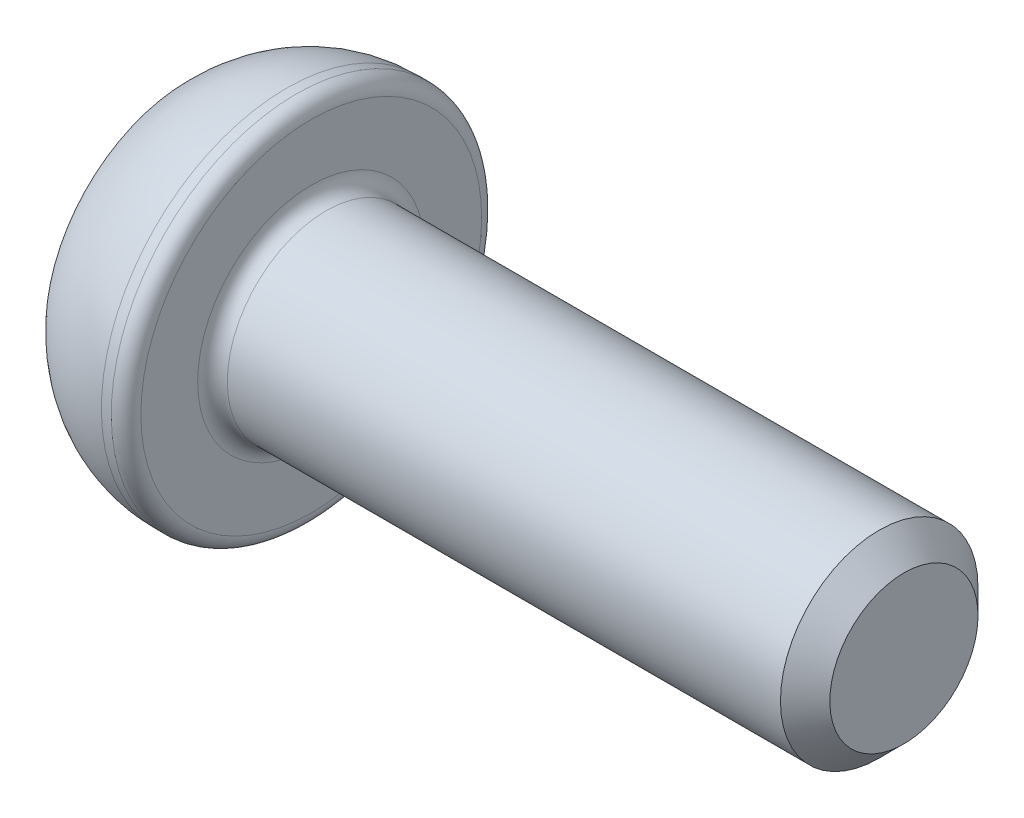
ISO-10303-21;
HEADER;
FILE_DESCRIPTION(('STEP AP214'),'2;1');
FILE_NAME('part.step','',(''),(''),'','','');
FILE_SCHEMA(('AUTOMOTIVE_DESIGN { 1 0 10303 214 1 1 1 1 }'));
ENDSEC;
DATA;
#1=APPLICATION_CONTEXT('core data for automotive mechanical design processes');
#2=APPLICATION_PROTOCOL_DEFINITION('international standard','automotive_design',2000,#1);
#3=PRODUCT_CONTEXT('',#1,'mechanical');
#4=PRODUCT('Part','Part','',(#3));
#5=PRODUCT_RELATED_PRODUCT_CATEGORY('part','',(#4));
#6=PRODUCT_DEFINITION_FORMATION('','',#4);
#7=PRODUCT_DEFINITION_CONTEXT('part definition',#1,'design');
#8=PRODUCT_DEFINITION('design','',#6,#7);
#9=PRODUCT_DEFINITION_SHAPE('','',#8);
#10=(LENGTH_UNIT() NAMED_UNIT(*) SI_UNIT(.MILLI.,.METRE.));
#11=(NAMED_UNIT(*) PLANE_ANGLE_UNIT() SI_UNIT($,.RADIAN.));
#12=(NAMED_UNIT(*) SI_UNIT($,.STERADIAN.) SOLID_ANGLE_UNIT());
#13=UNCERTAINTY_MEASURE_WITH_UNIT(LENGTH_MEASURE(1.E-05),#10,'distance_accuracy_value','');
#14=(GEOMETRIC_REPRESENTATION_CONTEXT(3) GLOBAL_UNCERTAINTY_ASSIGNED_CONTEXT((#13)) GLOBAL_UNIT_ASSIGNED_CONTEXT((#10,
#11,#12)) REPRESENTATION_CONTEXT('',''));
#15=CARTESIAN_POINT('',(0.,0.,0.));
#16=DIRECTION('',(0.,0.,1.));
#17=DIRECTION('',(1.,0.,0.));
#18=AXIS2_PLACEMENT_3D('',#15,#16,#17);
#19=CARTESIAN_POINT('',(0.,0.,0.));
#20=DIRECTION('',(-1.,0.,0.));
#21=DIRECTION('',(0.,-1.,0.));
#22=AXIS2_PLACEMENT_3D('',#19,#20,#21);
#23=PLANE('',#22);
#24=DIRECTION('',(0.,0.866025403784438,-0.5));
#25=VECTOR('',#24,1.);
#26=CARTESIAN_POINT('',(0.,0.,1.44337567297407));
#27=LINE('',#26,#25);
#28=CARTESIAN_POINT('',(0.,0.,1.44337567297407));
#29=VERTEX_POINT('',#28);
#30=CARTESIAN_POINT('',(0.,1.25,0.721687836487032));
#31=VERTEX_POINT('',#30);
#32=EDGE_CURVE('E55',#29,#31,#27,.T.);
#33=ORIENTED_EDGE('',*,*,#32,.F.);
#34=DIRECTION('',(0.,0.866025403784438,0.5));
#35=VECTOR('',#34,1.);
#36=CARTESIAN_POINT('',(0.,-1.25,0.721687836487033));
#37=LINE('',#36,#35);
#38=CARTESIAN_POINT('',(0.,-1.25,0.721687836487033));
#39=VERTEX_POINT('',#38);
#40=EDGE_CURVE('E138',#39,#29,#37,.T.);
#41=ORIENTED_EDGE('',*,*,#40,.F.);
#42=DIRECTION('',(0.,0.,1.));
#43=VECTOR('',#42,1.);
#44=CARTESIAN_POINT('',(0.,-1.25,-0.721687836487032));
#45=LINE('',#44,#43);
#46=CARTESIAN_POINT('',(0.,-1.25,-0.721687836487032));
#47=VERTEX_POINT('',#46);
#48=EDGE_CURVE('E136',#47,#39,#45,.T.);
#49=ORIENTED_EDGE('',*,*,#48,.F.);
#50=DIRECTION('',(0.,-0.866025403784438,0.5));
#51=VECTOR('',#50,1.);
#52=CARTESIAN_POINT('',(0.,0.,-1.44337567297407));
#53=LINE('',#52,#51);
#54=CARTESIAN_POINT('',(0.,0.,-1.44337567297407));
#55=VERTEX_POINT('',#54);
#56=EDGE_CURVE('E103',#55,#47,#53,.T.);
#57=ORIENTED_EDGE('',*,*,#56,.F.);
#58=DIRECTION('',(0.,-0.866025403784438,-0.5));
#59=VECTOR('',#58,1.);
#60=CARTESIAN_POINT('',(0.,1.25,-0.721687836487032));
#61=LINE('',#60,#59);
#62=CARTESIAN_POINT('',(0.,1.25,-0.721687836487032));
#63=VERTEX_POINT('',#62);
#64=EDGE_CURVE('E132',#63,#55,#61,.T.);
#65=ORIENTED_EDGE('',*,*,#64,.F.);
#66=DIRECTION('',(0.,0.,-1.));
#67=VECTOR('',#66,1.);
#68=CARTESIAN_POINT('',(0.,1.25,0.721687836487032));
#69=LINE('',#68,#67);
#70=EDGE_CURVE('E129',#31,#63,#69,.T.);
#71=ORIENTED_EDGE('',*,*,#70,.F.);
#72=EDGE_LOOP('',(#33,#41,#49,#57,#65,#71));
#73=FACE_BOUND('',#72,.T.);
#74=CARTESIAN_POINT('',(0.,0.,0.));
#75=DIRECTION('',(1.,0.,0.));
#76=DIRECTION('',(0.,1.,0.));
#77=AXIS2_PLACEMENT_3D('',#74,#75,#76);
#78=CIRCLE('',#77,2.875);
#79=CARTESIAN_POINT('',(0.,2.875,0.));
#80=VERTEX_POINT('',#79);
#81=EDGE_CURVE('E150',#80,#80,#78,.T.);
#82=ORIENTED_EDGE('',*,*,#81,.F.);
#83=EDGE_LOOP('',(#82));
#84=FACE_BOUND('',#83,.T.);
#85=ADVANCED_FACE('F39',(#73,#84),#23,.T.);
#86=CARTESIAN_POINT('',(2.,0.,0.));
#87=DIRECTION('',(1.,0.,0.));
#88=DIRECTION('',(0.,1.,0.));
#89=AXIS2_PLACEMENT_3D('',#86,#87,#88);
#90=DEGENERATE_TOROIDAL_SURFACE('',#89,1.02678571428571,2.72321428571429,.T.);
#91=ORIENTED_EDGE('',*,*,#81,.T.);
#92=EDGE_LOOP('',(#91));
#93=FACE_BOUND('',#92,.T.);
#94=CARTESIAN_POINT('',(2.,0.,0.));
#95=DIRECTION('',(1.,0.,0.));
#96=DIRECTION('',(0.,1.,0.));
#97=AXIS2_PLACEMENT_3D('',#94,#95,#96);
#98=CIRCLE('',#97,3.75);
#99=CARTESIAN_POINT('',(2.,3.75,0.));
#100=VERTEX_POINT('',#99);
#101=EDGE_CURVE('E142',#100,#100,#98,.T.);
#102=ORIENTED_EDGE('',*,*,#101,.F.);
#103=EDGE_LOOP('',(#102));
#104=FACE_BOUND('',#103,.T.);
#105=ADVANCED_FACE('F179',(#93,#104),#90,.T.);
#106=CARTESIAN_POINT('',(14.5,0.,0.));
#107=DIRECTION('',(1.,0.,0.));
#108=DIRECTION('',(0.,1.,0.));
#109=AXIS2_PLACEMENT_3D('',#106,#107,#108);
#110=CYLINDRICAL_SURFACE('',#109,3.75);
#111=CARTESIAN_POINT('',(2.2,0.,0.));
#112=DIRECTION('',(1.,0.,0.));
#113=DIRECTION('',(0.,1.,0.));
#114=AXIS2_PLACEMENT_3D('',#111,#112,#113);
#115=CIRCLE('',#114,3.75);
#116=CARTESIAN_POINT('',(2.2,3.75,0.));
#117=VERTEX_POINT('',#116);
#118=EDGE_CURVE('E162',#117,#117,#115,.F.);
#119=ORIENTED_EDGE('',*,*,#118,.T.);
#120=EDGE_LOOP('',(#119));
#121=FACE_BOUND('',#120,.T.);
#122=ORIENTED_EDGE('',*,*,#101,.T.);
#123=EDGE_LOOP('',(#122));
#124=FACE_BOUND('',#123,.T.);
#125=ADVANCED_FACE('F185',(#121,#124),#110,.T.);
#126=CARTESIAN_POINT('',(2.5,3.75,0.));
#127=DIRECTION('',(1.,0.,0.));
#128=DIRECTION('',(0.,1.,0.));
#129=AXIS2_PLACEMENT_3D('',#126,#127,#128);
#130=PLANE('',#129);
#131=CARTESIAN_POINT('',(2.5,0.,0.));
#132=DIRECTION('',(1.,0.,0.));
#133=DIRECTION('',(0.,1.,0.));
#134=AXIS2_PLACEMENT_3D('',#131,#132,#133);
#135=CIRCLE('',#134,2.3);
#136=CARTESIAN_POINT('',(2.5,2.3,0.));
#137=VERTEX_POINT('',#136);
#138=EDGE_CURVE('E159',#137,#137,#135,.F.);
#139=ORIENTED_EDGE('',*,*,#138,.T.);
#140=EDGE_LOOP('',(#139));
#141=FACE_BOUND('',#140,.T.);
#142=CARTESIAN_POINT('',(2.5,0.,0.));
#143=DIRECTION('',(1.,0.,0.));
#144=DIRECTION('',(0.,1.,0.));
#145=AXIS2_PLACEMENT_3D('',#142,#143,#144);
#146=CIRCLE('',#145,3.45);
#147=CARTESIAN_POINT('',(2.5,3.45,0.));
#148=VERTEX_POINT('',#147);
#149=EDGE_CURVE('E156',#148,#148,#146,.T.);
#150=ORIENTED_EDGE('',*,*,#149,.T.);
#151=EDGE_LOOP('',(#150));
#152=FACE_BOUND('',#151,.T.);
#153=ADVANCED_FACE('F204',(#141,#152),#130,.T.);
#154=CARTESIAN_POINT('',(14.5,0.,0.));
#155=DIRECTION('',(1.,0.,0.));
#156=DIRECTION('',(0.,1.,0.));
#157=AXIS2_PLACEMENT_3D('',#154,#155,#156);
#158=CYLINDRICAL_SURFACE('',#157,2.);
#159=CARTESIAN_POINT('',(14.,0.,0.));
#160=DIRECTION('',(1.,0.,0.));
#161=DIRECTION('',(0.,1.,0.));
#162=AXIS2_PLACEMENT_3D('',#159,#160,#161);
#163=CIRCLE('',#162,2.);
#164=CARTESIAN_POINT('',(14.,2.,0.));
#165=VERTEX_POINT('',#164);
#166=EDGE_CURVE('E11',#165,#165,#163,.F.);
#167=ORIENTED_EDGE('',*,*,#166,.T.);
#168=EDGE_LOOP('',(#167));
#169=FACE_BOUND('',#168,.T.);
#170=CARTESIAN_POINT('',(2.8,0.,0.));
#171=DIRECTION('',(1.,0.,0.));
#172=DIRECTION('',(0.,1.,0.));
#173=AXIS2_PLACEMENT_3D('',#170,#171,#172);
#174=CIRCLE('',#173,2.);
#175=CARTESIAN_POINT('',(2.8,2.,0.));
#176=VERTEX_POINT('',#175);
#177=EDGE_CURVE('E153',#176,#176,#174,.T.);
#178=ORIENTED_EDGE('',*,*,#177,.T.);
#179=EDGE_LOOP('',(#178));
#180=FACE_BOUND('',#179,.T.);
#181=ADVANCED_FACE('F202',(#169,#180),#158,.T.);
#182=CARTESIAN_POINT('',(14.5,2.,0.));
#183=DIRECTION('',(1.,0.,0.));
#184=DIRECTION('',(0.,1.,0.));
#185=AXIS2_PLACEMENT_3D('',#182,#183,#184);
#186=PLANE('',#185);
#187=CARTESIAN_POINT('',(14.5,0.,0.));
#188=DIRECTION('',(1.,0.,0.));
#189=DIRECTION('',(0.,1.,0.));
#190=AXIS2_PLACEMENT_3D('',#187,#188,#189);
#191=CIRCLE('',#190,1.49999999999999);
#192=CARTESIAN_POINT('',(14.5,1.5,0.));
#193=VERTEX_POINT('',#192);
#194=EDGE_CURVE('E48',#193,#193,#191,.T.);
#195=ORIENTED_EDGE('',*,*,#194,.T.);
#196=EDGE_LOOP('',(#195));
#197=FACE_BOUND('',#196,.T.);
#198=ADVANCED_FACE('F167',(#197),#186,.T.);
#199=CARTESIAN_POINT('',(1.5,0.,1.44337567297407));
#200=DIRECTION('',(0.,0.5,0.866025403784438));
#201=DIRECTION('',(0.,-0.866025403784439,0.5));
#202=AXIS2_PLACEMENT_3D('',#199,#200,#201);
#203=PLANE('',#202);
#204=ORIENTED_EDGE('',*,*,#32,.T.);
#205=DIRECTION('',(-1.,0.,0.));
#206=VECTOR('',#205,1.);
#207=CARTESIAN_POINT('',(1.5,1.25,0.721687836487032));
#208=LINE('',#207,#206);
#209=CARTESIAN_POINT('',(1.5,1.25,0.721687836487032));
#210=VERTEX_POINT('',#209);
#211=EDGE_CURVE('E85',#210,#31,#208,.T.);
#212=ORIENTED_EDGE('',*,*,#211,.F.);
#213=DIRECTION('',(0.,0.866025403784438,-0.5));
#214=VECTOR('',#213,1.);
#215=CARTESIAN_POINT('',(1.5,0.,1.44337567297407));
#216=LINE('',#215,#214);
#217=CARTESIAN_POINT('',(1.5,0.,1.44337567297407));
#218=VERTEX_POINT('',#217);
#219=EDGE_CURVE('E140',#218,#210,#216,.T.);
#220=ORIENTED_EDGE('',*,*,#219,.F.);
#221=DIRECTION('',(-1.,0.,0.));
#222=VECTOR('',#221,1.);
#223=CARTESIAN_POINT('',(1.5,0.,1.44337567297407));
#224=LINE('',#223,#222);
#225=EDGE_CURVE('E63',#218,#29,#224,.T.);
#226=ORIENTED_EDGE('',*,*,#225,.T.);
#227=EDGE_LOOP('',(#204,#212,#220,#226));
#228=FACE_BOUND('',#227,.T.);
#229=ADVANCED_FACE('F211',(#228),#203,.F.);
#230=CARTESIAN_POINT('',(1.5,-1.25,0.721687836487033));
#231=DIRECTION('',(0.,-0.5,0.866025403784439));
#232=DIRECTION('',(0.,-0.866025403784439,-0.5));
#233=AXIS2_PLACEMENT_3D('',#230,#231,#232);
#234=PLANE('',#233);
#235=ORIENTED_EDGE('',*,*,#40,.T.);
#236=ORIENTED_EDGE('',*,*,#225,.F.);
#237=DIRECTION('',(0.,0.866025403784438,0.5));
#238=VECTOR('',#237,1.);
#239=CARTESIAN_POINT('',(1.5,-1.25,0.721687836487033));
#240=LINE('',#239,#238);
#241=CARTESIAN_POINT('',(1.5,-1.25,0.721687836487033));
#242=VERTEX_POINT('',#241);
#243=EDGE_CURVE('E115',#242,#218,#240,.T.);
#244=ORIENTED_EDGE('',*,*,#243,.F.);
#245=DIRECTION('',(-1.,0.,0.));
#246=VECTOR('',#245,1.);
#247=CARTESIAN_POINT('',(1.5,-1.25,0.721687836487033));
#248=LINE('',#247,#246);
#249=EDGE_CURVE('E107',#242,#39,#248,.T.);
#250=ORIENTED_EDGE('',*,*,#249,.T.);
#251=EDGE_LOOP('',(#235,#236,#244,#250));
#252=FACE_BOUND('',#251,.T.);
#253=ADVANCED_FACE('F270',(#252),#234,.F.);
#254=CARTESIAN_POINT('',(1.5,-1.25,-0.721687836487032));
#255=DIRECTION('',(0.,-1.,0.));
#256=DIRECTION('',(0.,0.,-1.));
#257=AXIS2_PLACEMENT_3D('',#254,#255,#256);
#258=PLANE('',#257);
#259=ORIENTED_EDGE('',*,*,#48,.T.);
#260=ORIENTED_EDGE('',*,*,#249,.F.);
#261=DIRECTION('',(0.,0.,1.));
#262=VECTOR('',#261,1.);
#263=CARTESIAN_POINT('',(1.5,-1.25,-0.721687836487032));
#264=LINE('',#263,#262);
#265=CARTESIAN_POINT('',(1.5,-1.25,-0.721687836487032));
#266=VERTEX_POINT('',#265);
#267=EDGE_CURVE('E111',#266,#242,#264,.T.);
#268=ORIENTED_EDGE('',*,*,#267,.F.);
#269=DIRECTION('',(-1.,0.,0.));
#270=VECTOR('',#269,1.);
#271=CARTESIAN_POINT('',(1.5,-1.25,-0.721687836487032));
#272=LINE('',#271,#270);
#273=EDGE_CURVE('E96',#266,#47,#272,.T.);
#274=ORIENTED_EDGE('',*,*,#273,.T.);
#275=EDGE_LOOP('',(#259,#260,#268,#274));
#276=FACE_BOUND('',#275,.T.);
#277=ADVANCED_FACE('F112',(#276),#258,.F.);
#278=CARTESIAN_POINT('',(1.5,0.,-1.44337567297407));
#279=DIRECTION('',(0.,-0.5,-0.866025403784439));
#280=DIRECTION('',(0.,0.866025403784439,-0.5));
#281=AXIS2_PLACEMENT_3D('',#278,#279,#280);
#282=PLANE('',#281);
#283=ORIENTED_EDGE('',*,*,#56,.T.);
#284=ORIENTED_EDGE('',*,*,#273,.F.);
#285=DIRECTION('',(0.,-0.866025403784438,0.5));
#286=VECTOR('',#285,1.);
#287=CARTESIAN_POINT('',(1.5,0.,-1.44337567297407));
#288=LINE('',#287,#286);
#289=CARTESIAN_POINT('',(1.5,0.,-1.44337567297407));
#290=VERTEX_POINT('',#289);
#291=EDGE_CURVE('E100',#290,#266,#288,.T.);
#292=ORIENTED_EDGE('',*,*,#291,.F.);
#293=DIRECTION('',(-1.,0.,0.));
#294=VECTOR('',#293,1.);
#295=CARTESIAN_POINT('',(1.5,0.,-1.44337567297407));
#296=LINE('',#295,#294);
#297=EDGE_CURVE('E108',#290,#55,#296,.T.);
#298=ORIENTED_EDGE('',*,*,#297,.T.);
#299=EDGE_LOOP('',(#283,#284,#292,#298));
#300=FACE_BOUND('',#299,.T.);
#301=ADVANCED_FACE('F98',(#300),#282,.F.);
#302=CARTESIAN_POINT('',(1.5,1.25,-0.721687836487032));
#303=DIRECTION('',(0.,0.5,-0.866025403784438));
#304=DIRECTION('',(0.,0.866025403784439,0.5));
#305=AXIS2_PLACEMENT_3D('',#302,#303,#304);
#306=PLANE('',#305);
#307=ORIENTED_EDGE('',*,*,#64,.T.);
#308=ORIENTED_EDGE('',*,*,#297,.F.);
#309=DIRECTION('',(0.,-0.866025403784438,-0.5));
#310=VECTOR('',#309,1.);
#311=CARTESIAN_POINT('',(1.5,1.25,-0.721687836487032));
#312=LINE('',#311,#310);
#313=CARTESIAN_POINT('',(1.5,1.25,-0.721687836487032));
#314=VERTEX_POINT('',#313);
#315=EDGE_CURVE('E121',#314,#290,#312,.T.);
#316=ORIENTED_EDGE('',*,*,#315,.F.);
#317=DIRECTION('',(-1.,0.,0.));
#318=VECTOR('',#317,1.);
#319=CARTESIAN_POINT('',(1.5,1.25,-0.721687836487032));
#320=LINE('',#319,#318);
#321=EDGE_CURVE('E145',#314,#63,#320,.T.);
#322=ORIENTED_EDGE('',*,*,#321,.T.);
#323=EDGE_LOOP('',(#307,#308,#316,#322));
#324=FACE_BOUND('',#323,.T.);
#325=ADVANCED_FACE('F287',(#324),#306,.F.);
#326=CARTESIAN_POINT('',(1.5,1.25,0.721687836487032));
#327=DIRECTION('',(0.,1.,0.));
#328=DIRECTION('',(0.,0.,1.));
#329=AXIS2_PLACEMENT_3D('',#326,#327,#328);
#330=PLANE('',#329);
#331=ORIENTED_EDGE('',*,*,#70,.T.);
#332=ORIENTED_EDGE('',*,*,#321,.F.);
#333=DIRECTION('',(0.,0.,-1.));
#334=VECTOR('',#333,1.);
#335=CARTESIAN_POINT('',(1.5,1.25,0.721687836487032));
#336=LINE('',#335,#334);
#337=EDGE_CURVE('E123',#210,#314,#336,.T.);
#338=ORIENTED_EDGE('',*,*,#337,.F.);
#339=ORIENTED_EDGE('',*,*,#211,.T.);
#340=EDGE_LOOP('',(#331,#332,#338,#339));
#341=FACE_BOUND('',#340,.T.);
#342=ADVANCED_FACE('F196',(#341),#330,.F.);
#343=CARTESIAN_POINT('',(1.5,0.,0.));
#344=DIRECTION('',(-1.,0.,0.));
#345=DIRECTION('',(0.,0.,1.));
#346=AXIS2_PLACEMENT_3D('',#343,#344,#345);
#347=PLANE('',#346);
#348=ORIENTED_EDGE('',*,*,#219,.T.);
#349=ORIENTED_EDGE('',*,*,#337,.T.);
#350=ORIENTED_EDGE('',*,*,#315,.T.);
#351=ORIENTED_EDGE('',*,*,#291,.T.);
#352=ORIENTED_EDGE('',*,*,#267,.T.);
#353=ORIENTED_EDGE('',*,*,#243,.T.);
#354=EDGE_LOOP('',(#348,#349,#350,#351,#352,#353));
#355=FACE_BOUND('',#354,.T.);
#356=ADVANCED_FACE('F118',(#355),#347,.T.);
#357=CARTESIAN_POINT('',(2.8,0.,0.));
#358=DIRECTION('',(1.,0.,0.));
#359=DIRECTION('',(0.,1.,0.));
#360=AXIS2_PLACEMENT_3D('',#357,#358,#359);
#361=TOROIDAL_SURFACE('',#360,2.3,0.3);
#362=ORIENTED_EDGE('',*,*,#138,.F.);
#363=EDGE_LOOP('',(#362));
#364=FACE_BOUND('',#363,.T.);
#365=ORIENTED_EDGE('',*,*,#177,.F.);
#366=EDGE_LOOP('',(#365));
#367=FACE_BOUND('',#366,.T.);
#368=ADVANCED_FACE('F175',(#364,#367),#361,.F.);
#369=CARTESIAN_POINT('',(2.2,0.,0.));
#370=DIRECTION('',(1.,0.,0.));
#371=DIRECTION('',(0.,1.,0.));
#372=AXIS2_PLACEMENT_3D('',#369,#370,#371);
#373=TOROIDAL_SURFACE('',#372,3.45,0.3);
#374=ORIENTED_EDGE('',*,*,#118,.F.);
#375=EDGE_LOOP('',(#374));
#376=FACE_BOUND('',#375,.T.);
#377=ORIENTED_EDGE('',*,*,#149,.F.);
#378=EDGE_LOOP('',(#377));
#379=FACE_BOUND('',#378,.T.);
#380=ADVANCED_FACE('F170',(#376,#379),#373,.T.);
#381=CARTESIAN_POINT('',(14.5,0.,0.));
#382=DIRECTION('',(-1.,0.,0.));
#383=DIRECTION('',(0.,-1.,0.));
#384=AXIS2_PLACEMENT_3D('',#381,#382,#383);
#385=CONICAL_SURFACE('',#384,1.49999999999999,0.785398163397447);
#386=ORIENTED_EDGE('',*,*,#166,.F.);
#387=EDGE_LOOP('',(#386));
#388=FACE_BOUND('',#387,.T.);
#389=ORIENTED_EDGE('',*,*,#194,.F.);
#390=EDGE_LOOP('',(#389));
#391=FACE_BOUND('',#390,.T.);
#392=ADVANCED_FACE('F42',(#388,#391),#385,.T.);
#393=CLOSED_SHELL('',(#85,#105,#125,#153,#181,#198,#229,#253,#277,#301,#325,#342,#356,#368,#380,#392));
#394=MANIFOLD_SOLID_BREP('B2',#393);
#395=ADVANCED_BREP_SHAPE_REPRESENTATION('',(#18,#394),#14);
#396=SHAPE_DEFINITION_REPRESENTATION(#9,#395);
ENDSEC;
END-ISO-10303-21;
